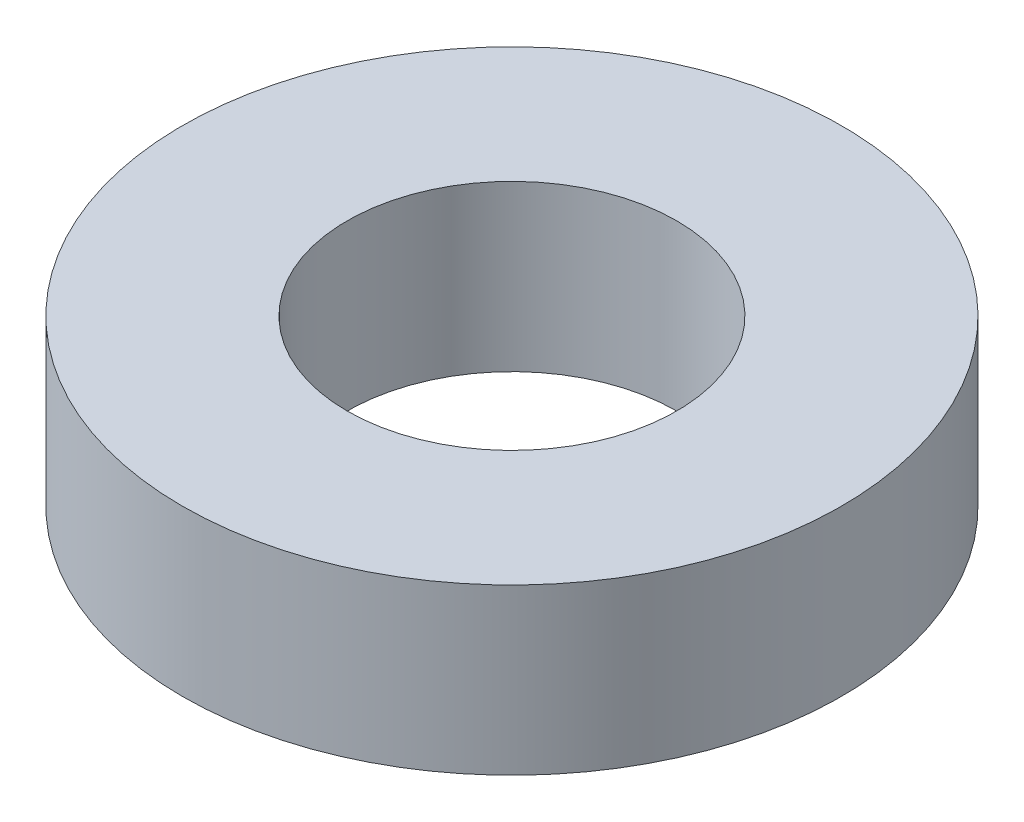
ISO-10303-21;
HEADER;
FILE_DESCRIPTION(('STEP AP214'),'2;1');
FILE_NAME('part.step','',(''),(''),'','','');
FILE_SCHEMA(('AUTOMOTIVE_DESIGN { 1 0 10303 214 1 1 1 1 }'));
ENDSEC;
DATA;
#1=APPLICATION_CONTEXT('core data for automotive mechanical design processes');
#2=APPLICATION_PROTOCOL_DEFINITION('international standard','automotive_design',2000,#1);
#3=PRODUCT_CONTEXT('',#1,'mechanical');
#4=PRODUCT('Part','Part','',(#3));
#5=PRODUCT_RELATED_PRODUCT_CATEGORY('part','',(#4));
#6=PRODUCT_DEFINITION_FORMATION('','',#4);
#7=PRODUCT_DEFINITION_CONTEXT('part definition',#1,'design');
#8=PRODUCT_DEFINITION('design','',#6,#7);
#9=PRODUCT_DEFINITION_SHAPE('','',#8);
#10=(LENGTH_UNIT() NAMED_UNIT(*) SI_UNIT(.MILLI.,.METRE.));
#11=(NAMED_UNIT(*) PLANE_ANGLE_UNIT() SI_UNIT($,.RADIAN.));
#12=(NAMED_UNIT(*) SI_UNIT($,.STERADIAN.) SOLID_ANGLE_UNIT());
#13=UNCERTAINTY_MEASURE_WITH_UNIT(LENGTH_MEASURE(1.E-05),#10,'distance_accuracy_value','');
#14=(GEOMETRIC_REPRESENTATION_CONTEXT(3) GLOBAL_UNCERTAINTY_ASSIGNED_CONTEXT((#13)) GLOBAL_UNIT_ASSIGNED_CONTEXT((#10,
#11,#12)) REPRESENTATION_CONTEXT('',''));
#15=CARTESIAN_POINT('',(0.,0.,0.));
#16=DIRECTION('',(0.,0.,1.));
#17=DIRECTION('',(1.,0.,0.));
#18=AXIS2_PLACEMENT_3D('',#15,#16,#17);
#19=CARTESIAN_POINT('',(0.,4.,0.));
#20=DIRECTION('',(0.,1.,0.));
#21=DIRECTION('',(0.,0.,1.));
#22=AXIS2_PLACEMENT_3D('',#19,#20,#21);
#23=PLANE('',#22);
#24=CARTESIAN_POINT('',(0.,4.,0.));
#25=DIRECTION('',(0.,1.,0.));
#26=DIRECTION('',(0.,0.,1.));
#27=AXIS2_PLACEMENT_3D('',#24,#25,#26);
#28=CIRCLE('',#27,8.);
#29=CARTESIAN_POINT('',(0.,4.,8.));
#30=VERTEX_POINT('',#29);
#31=EDGE_CURVE('E10',#30,#30,#28,.T.);
#32=ORIENTED_EDGE('',*,*,#31,.T.);
#33=EDGE_LOOP('',(#32));
#34=FACE_BOUND('',#33,.T.);
#35=CARTESIAN_POINT('',(0.,4.,0.));
#36=DIRECTION('',(0.,1.,0.));
#37=DIRECTION('',(0.,0.,1.));
#38=AXIS2_PLACEMENT_3D('',#35,#36,#37);
#39=CIRCLE('',#38,4.);
#40=CARTESIAN_POINT('',(0.,4.,4.));
#41=VERTEX_POINT('',#40);
#42=EDGE_CURVE('E50',#41,#41,#39,.T.);
#43=ORIENTED_EDGE('',*,*,#42,.F.);
#44=EDGE_LOOP('',(#43));
#45=FACE_BOUND('',#44,.T.);
#46=ADVANCED_FACE('F37',(#34,#45),#23,.T.);
#47=CARTESIAN_POINT('',(0.,0.,0.));
#48=DIRECTION('',(0.,1.,0.));
#49=DIRECTION('',(0.,0.,1.));
#50=AXIS2_PLACEMENT_3D('',#47,#48,#49);
#51=PLANE('',#50);
#52=CARTESIAN_POINT('',(0.,0.,0.));
#53=DIRECTION('',(0.,1.,0.));
#54=DIRECTION('',(0.,0.,1.));
#55=AXIS2_PLACEMENT_3D('',#52,#53,#54);
#56=CIRCLE('',#55,8.);
#57=CARTESIAN_POINT('',(0.,0.,8.));
#58=VERTEX_POINT('',#57);
#59=EDGE_CURVE('E41',#58,#58,#56,.T.);
#60=ORIENTED_EDGE('',*,*,#59,.F.);
#61=EDGE_LOOP('',(#60));
#62=FACE_BOUND('',#61,.T.);
#63=CARTESIAN_POINT('',(0.,0.,0.));
#64=DIRECTION('',(0.,1.,0.));
#65=DIRECTION('',(0.,0.,1.));
#66=AXIS2_PLACEMENT_3D('',#63,#64,#65);
#67=CIRCLE('',#66,4.);
#68=CARTESIAN_POINT('',(0.,0.,4.));
#69=VERTEX_POINT('',#68);
#70=EDGE_CURVE('E52',#69,#69,#67,.T.);
#71=ORIENTED_EDGE('',*,*,#70,.T.);
#72=EDGE_LOOP('',(#71));
#73=FACE_BOUND('',#72,.T.);
#74=ADVANCED_FACE('F64',(#62,#73),#51,.F.);
#75=CARTESIAN_POINT('',(0.,4.,0.));
#76=DIRECTION('',(0.,-1.,0.));
#77=DIRECTION('',(0.,0.,-1.));
#78=AXIS2_PLACEMENT_3D('',#75,#76,#77);
#79=CYLINDRICAL_SURFACE('',#78,8.);
#80=ORIENTED_EDGE('',*,*,#31,.F.);
#81=EDGE_LOOP('',(#80));
#82=FACE_BOUND('',#81,.T.);
#83=ORIENTED_EDGE('',*,*,#59,.T.);
#84=EDGE_LOOP('',(#83));
#85=FACE_BOUND('',#84,.T.);
#86=ADVANCED_FACE('F39',(#82,#85),#79,.T.);
#87=CARTESIAN_POINT('',(0.,4.,0.));
#88=DIRECTION('',(0.,-1.,0.));
#89=DIRECTION('',(0.,0.,-1.));
#90=AXIS2_PLACEMENT_3D('',#87,#88,#89);
#91=CYLINDRICAL_SURFACE('',#90,4.);
#92=ORIENTED_EDGE('',*,*,#42,.T.);
#93=EDGE_LOOP('',(#92));
#94=FACE_BOUND('',#93,.T.);
#95=ORIENTED_EDGE('',*,*,#70,.F.);
#96=EDGE_LOOP('',(#95));
#97=FACE_BOUND('',#96,.T.);
#98=ADVANCED_FACE('F60',(#94,#97),#91,.F.);
#99=CLOSED_SHELL('',(#46,#74,#86,#98));
#100=MANIFOLD_SOLID_BREP('B2',#99);
#101=ADVANCED_BREP_SHAPE_REPRESENTATION('',(#18,#100),#14);
#102=SHAPE_DEFINITION_REPRESENTATION(#9,#101);
ENDSEC;
END-ISO-10303-21;
